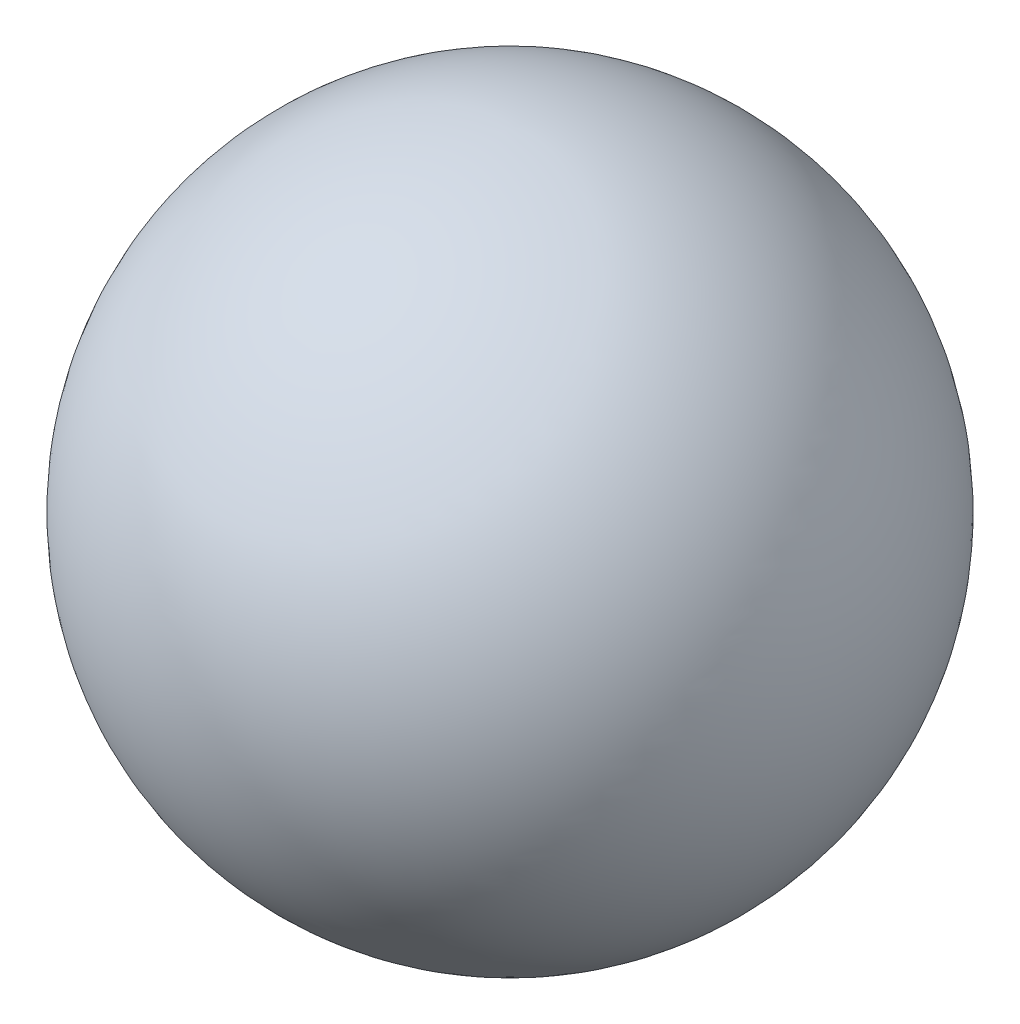
ISO-10303-21;
HEADER;
FILE_DESCRIPTION(('STEP AP214'),'2;1');
FILE_NAME('part.step','',(''),(''),'','','');
FILE_SCHEMA(('AUTOMOTIVE_DESIGN { 1 0 10303 214 1 1 1 1 }'));
ENDSEC;
DATA;
#1=APPLICATION_CONTEXT('core data for automotive mechanical design processes');
#2=APPLICATION_PROTOCOL_DEFINITION('international standard','automotive_design',2000,#1);
#3=PRODUCT_CONTEXT('',#1,'mechanical');
#4=PRODUCT('Part','Part','',(#3));
#5=PRODUCT_RELATED_PRODUCT_CATEGORY('part','',(#4));
#6=PRODUCT_DEFINITION_FORMATION('','',#4);
#7=PRODUCT_DEFINITION_CONTEXT('part definition',#1,'design');
#8=PRODUCT_DEFINITION('design','',#6,#7);
#9=PRODUCT_DEFINITION_SHAPE('','',#8);
#10=(LENGTH_UNIT() NAMED_UNIT(*) SI_UNIT(.MILLI.,.METRE.));
#11=(NAMED_UNIT(*) PLANE_ANGLE_UNIT() SI_UNIT($,.RADIAN.));
#12=(NAMED_UNIT(*) SI_UNIT($,.STERADIAN.) SOLID_ANGLE_UNIT());
#13=UNCERTAINTY_MEASURE_WITH_UNIT(LENGTH_MEASURE(1.E-05),#10,'distance_accuracy_value','');
#14=(GEOMETRIC_REPRESENTATION_CONTEXT(3) GLOBAL_UNCERTAINTY_ASSIGNED_CONTEXT((#13)) GLOBAL_UNIT_ASSIGNED_CONTEXT((#10,
#11,#12)) REPRESENTATION_CONTEXT('',''));
#15=CARTESIAN_POINT('',(0.,0.,0.));
#16=DIRECTION('',(0.,0.,1.));
#17=DIRECTION('',(1.,0.,0.));
#18=AXIS2_PLACEMENT_3D('',#15,#16,#17);
#19=CARTESIAN_POINT('',(0.0892103923912262,0.,0.));
#20=DIRECTION('',(0.,0.,-1.));
#21=DIRECTION('',(-1.,0.,0.));
#22=AXIS2_PLACEMENT_3D('',#19,#20,#21);
#23=CIRCLE('',#22,6.35062662216183);
#24=TRIMMED_CURVE('',#23,(PARAMETER_VALUE(-1.5567483702747)),(PARAMETER_VALUE(1.5567483702747)),
.T.,.PARAMETER.);
#25=CARTESIAN_POINT('',(0.,0.,0.));
#26=DIRECTION('',(0.,1.,0.));
#27=AXIS1_PLACEMENT('',#25,#26);
#28=SURFACE_OF_REVOLUTION('',#24,#27);
#29=CARTESIAN_POINT('',(0.,6.35,0.));
#30=VERTEX_POINT('',#29);
#31=VERTEX_LOOP('',#30);
#32=FACE_BOUND('',#31,.T.);
#33=CARTESIAN_POINT('',(0.,-6.35,0.));
#34=VERTEX_POINT('',#33);
#35=VERTEX_LOOP('',#34);
#36=FACE_BOUND('',#35,.T.);
#37=ADVANCED_FACE('F31',(#32,#36),#28,.T.);
#38=CLOSED_SHELL('',(#37));
#39=MANIFOLD_SOLID_BREP('B2',#38);
#40=ADVANCED_BREP_SHAPE_REPRESENTATION('',(#18,#39),#14);
#41=SHAPE_DEFINITION_REPRESENTATION(#9,#40);
ENDSEC;
END-ISO-10303-21;
